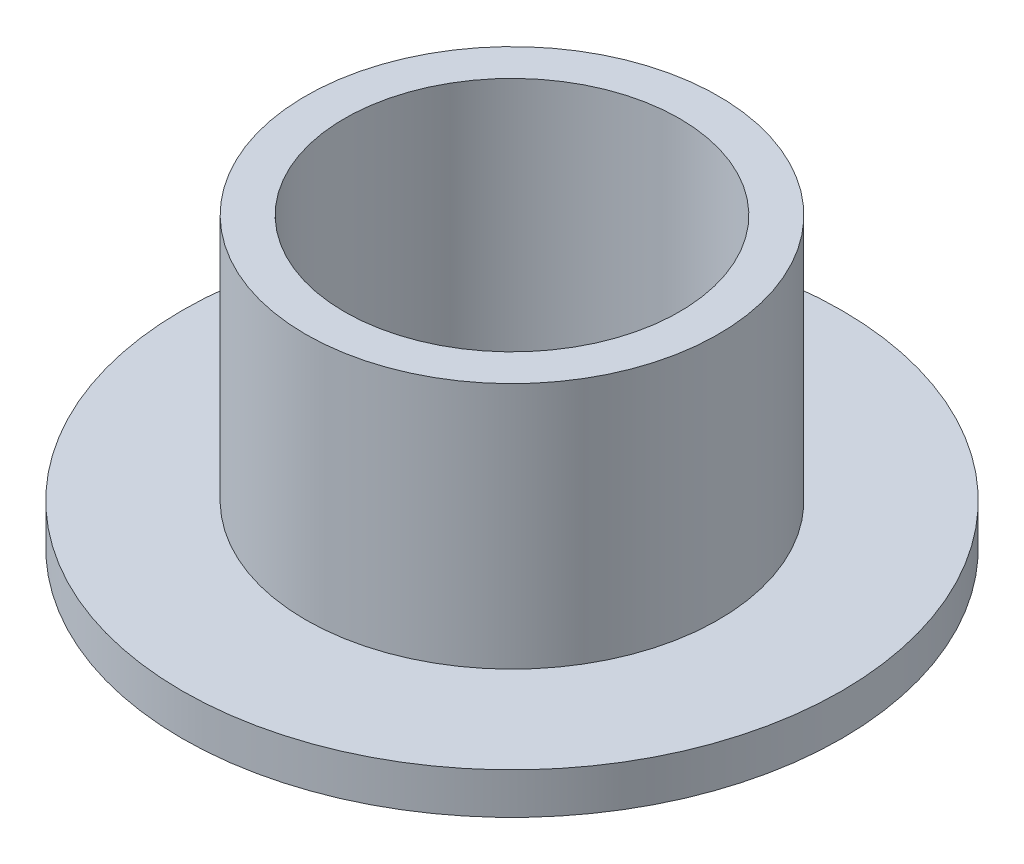
ISO-10303-21;
HEADER;
FILE_DESCRIPTION(('STEP AP214'),'2;1');
FILE_NAME('part.step','',(''),(''),'','','');
FILE_SCHEMA(('AUTOMOTIVE_DESIGN { 1 0 10303 214 1 1 1 1 }'));
ENDSEC;
DATA;
#1=APPLICATION_CONTEXT('core data for automotive mechanical design processes');
#2=APPLICATION_PROTOCOL_DEFINITION('international standard','automotive_design',2000,#1);
#3=PRODUCT_CONTEXT('',#1,'mechanical');
#4=PRODUCT('Part','Part','',(#3));
#5=PRODUCT_RELATED_PRODUCT_CATEGORY('part','',(#4));
#6=PRODUCT_DEFINITION_FORMATION('','',#4);
#7=PRODUCT_DEFINITION_CONTEXT('part definition',#1,'design');
#8=PRODUCT_DEFINITION('design','',#6,#7);
#9=PRODUCT_DEFINITION_SHAPE('','',#8);
#10=(LENGTH_UNIT() NAMED_UNIT(*) SI_UNIT(.MILLI.,.METRE.));
#11=(NAMED_UNIT(*) PLANE_ANGLE_UNIT() SI_UNIT($,.RADIAN.));
#12=(NAMED_UNIT(*) SI_UNIT($,.STERADIAN.) SOLID_ANGLE_UNIT());
#13=UNCERTAINTY_MEASURE_WITH_UNIT(LENGTH_MEASURE(1.E-05),#10,'distance_accuracy_value','');
#14=(GEOMETRIC_REPRESENTATION_CONTEXT(3) GLOBAL_UNCERTAINTY_ASSIGNED_CONTEXT((#13)) GLOBAL_UNIT_ASSIGNED_CONTEXT((#10,
#11,#12)) REPRESENTATION_CONTEXT('',''));
#15=CARTESIAN_POINT('',(0.,0.,0.));
#16=DIRECTION('',(0.,0.,1.));
#17=DIRECTION('',(1.,0.,0.));
#18=AXIS2_PLACEMENT_3D('',#15,#16,#17);
#19=CARTESIAN_POINT('',(0.,12.7,0.));
#20=DIRECTION('',(0.,-1.,0.));
#21=DIRECTION('',(0.,0.,-1.));
#22=AXIS2_PLACEMENT_3D('',#19,#20,#21);
#23=CYLINDRICAL_SURFACE('',#22,3.9751);
#24=CARTESIAN_POINT('',(0.,0.79375,0.));
#25=DIRECTION('',(0.,1.,0.));
#26=DIRECTION('',(0.,0.,1.));
#27=AXIS2_PLACEMENT_3D('',#24,#25,#26);
#28=CIRCLE('',#27,3.9751);
#29=CARTESIAN_POINT('',(0.,0.79375,3.9751));
#30=VERTEX_POINT('',#29);
#31=EDGE_CURVE('E55',#30,#30,#28,.T.);
#32=ORIENTED_EDGE('',*,*,#31,.T.);
#33=EDGE_LOOP('',(#32));
#34=FACE_BOUND('',#33,.T.);
#35=CARTESIAN_POINT('',(0.,5.55625,0.));
#36=DIRECTION('',(0.,1.,0.));
#37=DIRECTION('',(0.,0.,1.));
#38=AXIS2_PLACEMENT_3D('',#35,#36,#37);
#39=CIRCLE('',#38,3.9751);
#40=CARTESIAN_POINT('',(0.,5.55625,3.9751));
#41=VERTEX_POINT('',#40);
#42=EDGE_CURVE('E60',#41,#41,#39,.T.);
#43=ORIENTED_EDGE('',*,*,#42,.F.);
#44=EDGE_LOOP('',(#43));
#45=FACE_BOUND('',#44,.T.);
#46=ADVANCED_FACE('F37',(#34,#45),#23,.T.);
#47=CARTESIAN_POINT('',(0.,12.7,0.));
#48=DIRECTION('',(0.,-1.,0.));
#49=DIRECTION('',(0.,0.,-1.));
#50=AXIS2_PLACEMENT_3D('',#47,#48,#49);
#51=CYLINDRICAL_SURFACE('',#50,3.2258);
#52=CARTESIAN_POINT('',(0.,0.,0.));
#53=DIRECTION('',(0.,1.,0.));
#54=DIRECTION('',(0.,0.,1.));
#55=AXIS2_PLACEMENT_3D('',#52,#53,#54);
#56=CIRCLE('',#55,3.2258);
#57=CARTESIAN_POINT('',(0.,0.,3.2258));
#58=VERTEX_POINT('',#57);
#59=EDGE_CURVE('E10',#58,#58,#56,.T.);
#60=ORIENTED_EDGE('',*,*,#59,.F.);
#61=EDGE_LOOP('',(#60));
#62=FACE_BOUND('',#61,.T.);
#63=CARTESIAN_POINT('',(0.,5.55625,0.));
#64=DIRECTION('',(0.,1.,0.));
#65=DIRECTION('',(0.,0.,1.));
#66=AXIS2_PLACEMENT_3D('',#63,#64,#65);
#67=CIRCLE('',#66,3.2258);
#68=CARTESIAN_POINT('',(0.,5.55625,3.2258));
#69=VERTEX_POINT('',#68);
#70=EDGE_CURVE('E40',#69,#69,#67,.T.);
#71=ORIENTED_EDGE('',*,*,#70,.T.);
#72=EDGE_LOOP('',(#71));
#73=FACE_BOUND('',#72,.T.);
#74=ADVANCED_FACE('F69',(#62,#73),#51,.F.);
#75=CARTESIAN_POINT('',(0.,0.,0.));
#76=DIRECTION('',(0.,1.,0.));
#77=DIRECTION('',(0.,0.,1.));
#78=AXIS2_PLACEMENT_3D('',#75,#76,#77);
#79=PLANE('',#78);
#80=ORIENTED_EDGE('',*,*,#59,.T.);
#81=EDGE_LOOP('',(#80));
#82=FACE_BOUND('',#81,.T.);
#83=CARTESIAN_POINT('',(0.,0.,0.));
#84=DIRECTION('',(0.,1.,0.));
#85=DIRECTION('',(0.,0.,1.));
#86=AXIS2_PLACEMENT_3D('',#83,#84,#85);
#87=CIRCLE('',#86,6.35);
#88=CARTESIAN_POINT('',(0.,0.,6.35));
#89=VERTEX_POINT('',#88);
#90=EDGE_CURVE('E50',#89,#89,#87,.T.);
#91=ORIENTED_EDGE('',*,*,#90,.F.);
#92=EDGE_LOOP('',(#91));
#93=FACE_BOUND('',#92,.T.);
#94=ADVANCED_FACE('F87',(#82,#93),#79,.F.);
#95=CARTESIAN_POINT('',(0.,0.79375,0.));
#96=DIRECTION('',(0.,1.,0.));
#97=DIRECTION('',(0.,0.,1.));
#98=AXIS2_PLACEMENT_3D('',#95,#96,#97);
#99=PLANE('',#98);
#100=CARTESIAN_POINT('',(0.,0.79375,0.));
#101=DIRECTION('',(0.,1.,0.));
#102=DIRECTION('',(0.,0.,1.));
#103=AXIS2_PLACEMENT_3D('',#100,#101,#102);
#104=CIRCLE('',#103,6.35);
#105=CARTESIAN_POINT('',(0.,0.79375,6.35));
#106=VERTEX_POINT('',#105);
#107=EDGE_CURVE('E45',#106,#106,#104,.T.);
#108=ORIENTED_EDGE('',*,*,#107,.T.);
#109=EDGE_LOOP('',(#108));
#110=FACE_BOUND('',#109,.T.);
#111=ORIENTED_EDGE('',*,*,#31,.F.);
#112=EDGE_LOOP('',(#111));
#113=FACE_BOUND('',#112,.T.);
#114=ADVANCED_FACE('F78',(#110,#113),#99,.T.);
#115=CARTESIAN_POINT('',(0.,0.79375,0.));
#116=DIRECTION('',(0.,-1.,0.));
#117=DIRECTION('',(0.,0.,-1.));
#118=AXIS2_PLACEMENT_3D('',#115,#116,#117);
#119=CYLINDRICAL_SURFACE('',#118,6.35);
#120=ORIENTED_EDGE('',*,*,#107,.F.);
#121=EDGE_LOOP('',(#120));
#122=FACE_BOUND('',#121,.T.);
#123=ORIENTED_EDGE('',*,*,#90,.T.);
#124=EDGE_LOOP('',(#123));
#125=FACE_BOUND('',#124,.T.);
#126=ADVANCED_FACE('F73',(#122,#125),#119,.T.);
#127=CARTESIAN_POINT('',(0.,5.55625,0.));
#128=DIRECTION('',(0.,1.,0.));
#129=DIRECTION('',(0.,0.,1.));
#130=AXIS2_PLACEMENT_3D('',#127,#128,#129);
#131=PLANE('',#130);
#132=ORIENTED_EDGE('',*,*,#70,.F.);
#133=EDGE_LOOP('',(#132));
#134=FACE_BOUND('',#133,.T.);
#135=ORIENTED_EDGE('',*,*,#42,.T.);
#136=EDGE_LOOP('',(#135));
#137=FACE_BOUND('',#136,.T.);
#138=ADVANCED_FACE('F71',(#134,#137),#131,.T.);
#139=CLOSED_SHELL('',(#46,#74,#94,#114,#126,#138));
#140=MANIFOLD_SOLID_BREP('B2',#139);
#141=ADVANCED_BREP_SHAPE_REPRESENTATION('',(#18,#140),#14);
#142=SHAPE_DEFINITION_REPRESENTATION(#9,#141);
ENDSEC;
END-ISO-10303-21;
